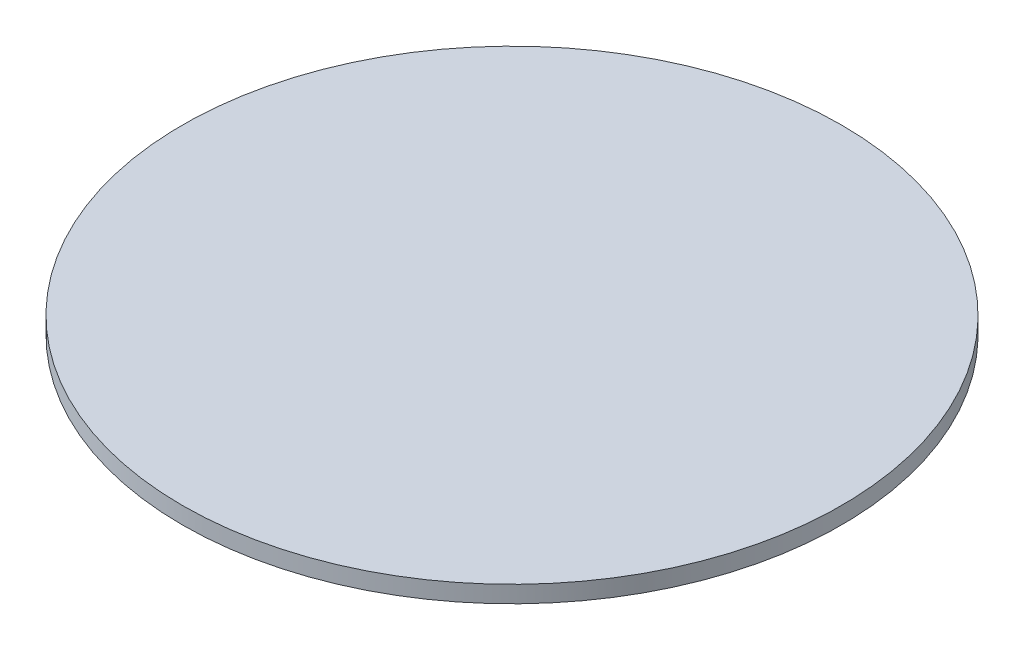
ISO-10303-21;
HEADER;
FILE_DESCRIPTION(('STEP AP214'),'2;1');
FILE_NAME('part.step','',(''),(''),'','','');
FILE_SCHEMA(('AUTOMOTIVE_DESIGN { 1 0 10303 214 1 1 1 1 }'));
ENDSEC;
DATA;
#1=APPLICATION_CONTEXT('core data for automotive mechanical design processes');
#2=APPLICATION_PROTOCOL_DEFINITION('international standard','automotive_design',2000,#1);
#3=PRODUCT_CONTEXT('',#1,'mechanical');
#4=PRODUCT('Part','Part','',(#3));
#5=PRODUCT_RELATED_PRODUCT_CATEGORY('part','',(#4));
#6=PRODUCT_DEFINITION_FORMATION('','',#4);
#7=PRODUCT_DEFINITION_CONTEXT('part definition',#1,'design');
#8=PRODUCT_DEFINITION('design','',#6,#7);
#9=PRODUCT_DEFINITION_SHAPE('','',#8);
#10=(LENGTH_UNIT() NAMED_UNIT(*) SI_UNIT(.MILLI.,.METRE.));
#11=(NAMED_UNIT(*) PLANE_ANGLE_UNIT() SI_UNIT($,.RADIAN.));
#12=(NAMED_UNIT(*) SI_UNIT($,.STERADIAN.) SOLID_ANGLE_UNIT());
#13=UNCERTAINTY_MEASURE_WITH_UNIT(LENGTH_MEASURE(1.E-05),#10,'distance_accuracy_value','');
#14=(GEOMETRIC_REPRESENTATION_CONTEXT(3) GLOBAL_UNCERTAINTY_ASSIGNED_CONTEXT((#13)) GLOBAL_UNIT_ASSIGNED_CONTEXT((#10,
#11,#12)) REPRESENTATION_CONTEXT('',''));
#15=CARTESIAN_POINT('',(0.,0.,0.));
#16=DIRECTION('',(0.,0.,1.));
#17=DIRECTION('',(1.,0.,0.));
#18=AXIS2_PLACEMENT_3D('',#15,#16,#17);
#19=CARTESIAN_POINT('',(0.,1.,0.));
#20=DIRECTION('',(0.,-1.,0.));
#21=DIRECTION('',(0.,0.,-1.));
#22=AXIS2_PLACEMENT_3D('',#19,#20,#21);
#23=CYLINDRICAL_SURFACE('',#22,19.5);
#24=CARTESIAN_POINT('',(0.,1.,0.));
#25=DIRECTION('',(0.,1.,0.));
#26=DIRECTION('',(0.,0.,1.));
#27=AXIS2_PLACEMENT_3D('',#24,#25,#26);
#28=CIRCLE('',#27,19.5);
#29=CARTESIAN_POINT('',(0.,1.,19.5));
#30=VERTEX_POINT('',#29);
#31=EDGE_CURVE('E10',#30,#30,#28,.T.);
#32=ORIENTED_EDGE('',*,*,#31,.F.);
#33=EDGE_LOOP('',(#32));
#34=FACE_BOUND('',#33,.T.);
#35=CARTESIAN_POINT('',(0.,0.,0.));
#36=DIRECTION('',(0.,1.,0.));
#37=DIRECTION('',(0.,0.,1.));
#38=AXIS2_PLACEMENT_3D('',#35,#36,#37);
#39=CIRCLE('',#38,19.5);
#40=CARTESIAN_POINT('',(0.,0.,19.5));
#41=VERTEX_POINT('',#40);
#42=EDGE_CURVE('E33',#41,#41,#39,.T.);
#43=ORIENTED_EDGE('',*,*,#42,.T.);
#44=EDGE_LOOP('',(#43));
#45=FACE_BOUND('',#44,.T.);
#46=ADVANCED_FACE('F30',(#34,#45),#23,.T.);
#47=CARTESIAN_POINT('',(0.,1.,0.));
#48=DIRECTION('',(0.,1.,0.));
#49=DIRECTION('',(0.,0.,1.));
#50=AXIS2_PLACEMENT_3D('',#47,#48,#49);
#51=PLANE('',#50);
#52=ORIENTED_EDGE('',*,*,#31,.T.);
#53=EDGE_LOOP('',(#52));
#54=FACE_BOUND('',#53,.T.);
#55=ADVANCED_FACE('F45',(#54),#51,.T.);
#56=CARTESIAN_POINT('',(0.,0.,0.));
#57=DIRECTION('',(0.,1.,0.));
#58=DIRECTION('',(0.,0.,1.));
#59=AXIS2_PLACEMENT_3D('',#56,#57,#58);
#60=PLANE('',#59);
#61=ORIENTED_EDGE('',*,*,#42,.F.);
#62=EDGE_LOOP('',(#61));
#63=FACE_BOUND('',#62,.T.);
#64=ADVANCED_FACE('F43',(#63),#60,.F.);
#65=CLOSED_SHELL('',(#46,#55,#64));
#66=MANIFOLD_SOLID_BREP('B2',#65);
#67=ADVANCED_BREP_SHAPE_REPRESENTATION('',(#18,#66),#14);
#68=SHAPE_DEFINITION_REPRESENTATION(#9,#67);
ENDSEC;
END-ISO-10303-21;
